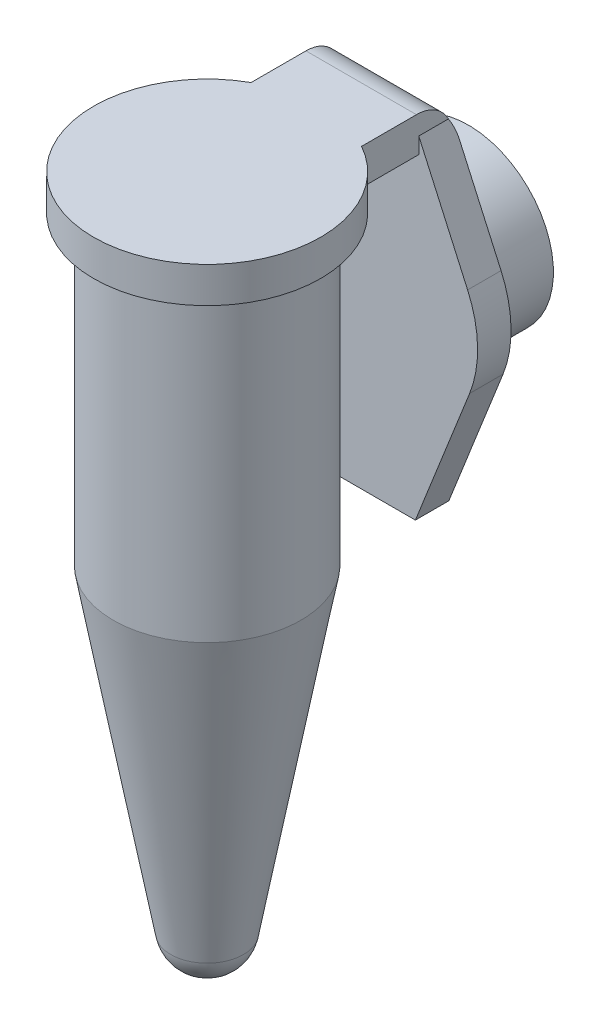
ISO-10303-21;
HEADER;
FILE_DESCRIPTION(('STEP AP214'),'2;1');
FILE_NAME('part.step','',(''),(''),'','','');
FILE_SCHEMA(('AUTOMOTIVE_DESIGN { 1 0 10303 214 1 1 1 1 }'));
ENDSEC;
DATA;
#1=APPLICATION_CONTEXT('core data for automotive mechanical design processes');
#2=APPLICATION_PROTOCOL_DEFINITION('international standard','automotive_design',2000,#1);
#3=PRODUCT_CONTEXT('',#1,'mechanical');
#4=PRODUCT('Part','Part','',(#3));
#5=PRODUCT_RELATED_PRODUCT_CATEGORY('part','',(#4));
#6=PRODUCT_DEFINITION_FORMATION('','',#4);
#7=PRODUCT_DEFINITION_CONTEXT('part definition',#1,'design');
#8=PRODUCT_DEFINITION('design','',#6,#7);
#9=PRODUCT_DEFINITION_SHAPE('','',#8);
#10=(LENGTH_UNIT() NAMED_UNIT(*) SI_UNIT(.MILLI.,.METRE.));
#11=(NAMED_UNIT(*) PLANE_ANGLE_UNIT() SI_UNIT($,.RADIAN.));
#12=(NAMED_UNIT(*) SI_UNIT($,.STERADIAN.) SOLID_ANGLE_UNIT());
#13=UNCERTAINTY_MEASURE_WITH_UNIT(LENGTH_MEASURE(1.E-05),#10,'distance_accuracy_value','');
#14=(GEOMETRIC_REPRESENTATION_CONTEXT(3) GLOBAL_UNCERTAINTY_ASSIGNED_CONTEXT((#13)) GLOBAL_UNIT_ASSIGNED_CONTEXT((#10,
#11,#12)) REPRESENTATION_CONTEXT('',''));
#15=CARTESIAN_POINT('',(0.,0.,0.));
#16=DIRECTION('',(0.,0.,1.));
#17=DIRECTION('',(1.,0.,0.));
#18=AXIS2_PLACEMENT_3D('',#15,#16,#17);
#19=CARTESIAN_POINT('',(0.,28.8,-10.6174678908489));
#20=DIRECTION('',(0.,0.,-1.));
#21=DIRECTION('',(-1.,0.,0.));
#22=AXIS2_PLACEMENT_3D('',#19,#20,#21);
#23=PLANE('',#22);
#24=DIRECTION('',(0.409269157803087,0.912413698094867,0.));
#25=VECTOR('',#24,1.);
#26=CARTESIAN_POINT('',(-5.82119939384525,31.4111372267837,-10.6174678908489));
#27=LINE('',#26,#25);
#28=CARTESIAN_POINT('',(-5.82119939384525,31.4111372267837,-10.6174678908489));
#29=VERTEX_POINT('',#28);
#30=CARTESIAN_POINT('',(-3.49370091197873,36.6,-10.6174678908489));
#31=VERTEX_POINT('',#30);
#32=EDGE_CURVE('E180',#29,#31,#27,.T.);
#33=ORIENTED_EDGE('',*,*,#32,.T.);
#34=DIRECTION('',(1.,0.,0.));
#35=VECTOR('',#34,1.);
#36=CARTESIAN_POINT('',(0.,36.6,-10.6174678908489));
#37=LINE('',#36,#35);
#38=CARTESIAN_POINT('',(3.49370091197873,36.6,-10.6174678908489));
#39=VERTEX_POINT('',#38);
#40=EDGE_CURVE('E150',#31,#39,#37,.T.);
#41=ORIENTED_EDGE('',*,*,#40,.T.);
#42=DIRECTION('',(0.409269157803087,-0.912413698094868,0.));
#43=VECTOR('',#42,1.);
#44=CARTESIAN_POINT('',(5.82119939384525,31.4111372267837,-10.6174678908489));
#45=LINE('',#44,#43);
#46=CARTESIAN_POINT('',(5.82119939384525,31.4111372267837,-10.6174678908489));
#47=VERTEX_POINT('',#46);
#48=EDGE_CURVE('E142',#39,#47,#45,.T.);
#49=ORIENTED_EDGE('',*,*,#48,.T.);
#50=CARTESIAN_POINT('',(0.,28.8,-10.6174678908489));
#51=DIRECTION('',(0.,0.,-1.));
#52=DIRECTION('',(-1.,0.,0.));
#53=AXIS2_PLACEMENT_3D('',#50,#51,#52);
#54=CIRCLE('',#53,6.38);
#55=CARTESIAN_POINT('',(5.93128800673835,26.4496335219541,-10.6174678908489));
#56=VERTEX_POINT('',#55);
#57=EDGE_CURVE('E147',#47,#56,#54,.T.);
#58=ORIENTED_EDGE('',*,*,#57,.T.);
#59=DIRECTION('',(-0.368395999693712,-0.929668966573409,0.));
#60=VECTOR('',#59,1.);
#61=CARTESIAN_POINT('',(2.9,18.8,-10.6174678908489));
#62=LINE('',#61,#60);
#63=CARTESIAN_POINT('',(2.9,18.8,-10.6174678908489));
#64=VERTEX_POINT('',#63);
#65=EDGE_CURVE('E169',#56,#64,#62,.T.);
#66=ORIENTED_EDGE('',*,*,#65,.T.);
#67=DIRECTION('',(-1.,0.,0.));
#68=VECTOR('',#67,1.);
#69=CARTESIAN_POINT('',(2.9,18.8,-10.6174678908489));
#70=LINE('',#69,#68);
#71=CARTESIAN_POINT('',(-2.9,18.8,-10.6174678908489));
#72=VERTEX_POINT('',#71);
#73=EDGE_CURVE('E171',#64,#72,#70,.T.);
#74=ORIENTED_EDGE('',*,*,#73,.T.);
#75=DIRECTION('',(-0.368395999693711,0.929668966573409,0.));
#76=VECTOR('',#75,1.);
#77=CARTESIAN_POINT('',(-2.9,18.8,-10.6174678908489));
#78=LINE('',#77,#76);
#79=CARTESIAN_POINT('',(-5.93128800673835,26.4496335219541,-10.6174678908489));
#80=VERTEX_POINT('',#79);
#81=EDGE_CURVE('E176',#72,#80,#78,.T.);
#82=ORIENTED_EDGE('',*,*,#81,.T.);
#83=CARTESIAN_POINT('',(0.,28.8,-10.6174678908489));
#84=DIRECTION('',(0.,0.,-1.));
#85=DIRECTION('',(-1.,0.,0.));
#86=AXIS2_PLACEMENT_3D('',#83,#84,#85);
#87=CIRCLE('',#86,6.38);
#88=EDGE_CURVE('E178',#80,#29,#87,.T.);
#89=ORIENTED_EDGE('',*,*,#88,.T.);
#90=EDGE_LOOP('',(#33,#41,#49,#58,#66,#74,#82,#89));
#91=FACE_BOUND('',#90,.T.);
#92=CARTESIAN_POINT('',(0.,28.8,-10.6174678908489));
#93=DIRECTION('',(0.,0.,-1.));
#94=DIRECTION('',(-1.,0.,0.));
#95=AXIS2_PLACEMENT_3D('',#92,#93,#94);
#96=CIRCLE('',#95,4.75);
#97=CARTESIAN_POINT('',(-4.75,28.8,-10.6174678908489));
#98=VERTEX_POINT('',#97);
#99=EDGE_CURVE('E309',#98,#98,#96,.T.);
#100=ORIENTED_EDGE('',*,*,#99,.F.);
#101=EDGE_LOOP('',(#100));
#102=FACE_BOUND('',#101,.T.);
#103=ADVANCED_FACE('F39',(#91,#102),#23,.T.);
#104=CARTESIAN_POINT('',(6.35,36.6,0.));
#105=DIRECTION('',(0.,-1.,0.));
#106=DIRECTION('',(0.,0.,-1.));
#107=AXIS2_PLACEMENT_3D('',#104,#105,#106);
#108=PLANE('',#107);
#109=CARTESIAN_POINT('',(0.,36.6,0.));
#110=DIRECTION('',(0.,-1.,0.));
#111=DIRECTION('',(0.,0.,-1.));
#112=AXIS2_PLACEMENT_3D('',#109,#110,#111);
#113=CIRCLE('',#112,6.35);
#114=CARTESIAN_POINT('',(3.09,36.6,-5.54746789084894));
#115=VERTEX_POINT('',#114);
#116=CARTESIAN_POINT('',(-3.09,36.6,-5.54746789084894));
#117=VERTEX_POINT('',#116);
#118=EDGE_CURVE('E238',#115,#117,#113,.T.);
#119=ORIENTED_EDGE('',*,*,#118,.T.);
#120=DIRECTION('',(0.,0.,1.));
#121=VECTOR('',#120,1.);
#122=CARTESIAN_POINT('',(-3.09,36.6,-5.54746789084894));
#123=LINE('',#122,#121);
#124=CARTESIAN_POINT('',(-3.09,36.6,-8.74746789084894));
#125=VERTEX_POINT('',#124);
#126=EDGE_CURVE('E210',#125,#117,#123,.T.);
#127=ORIENTED_EDGE('',*,*,#126,.F.);
#128=DIRECTION('',(-1.,0.,0.));
#129=VECTOR('',#128,1.);
#130=CARTESIAN_POINT('',(-3.09,36.6,-8.74746789084894));
#131=LINE('',#130,#129);
#132=CARTESIAN_POINT('',(3.09,36.6,-8.74746789084894));
#133=VERTEX_POINT('',#132);
#134=EDGE_CURVE('E218',#133,#125,#131,.T.);
#135=ORIENTED_EDGE('',*,*,#134,.F.);
#136=DIRECTION('',(0.,0.,-1.));
#137=VECTOR('',#136,1.);
#138=CARTESIAN_POINT('',(3.09,36.6,-5.54746789084894));
#139=LINE('',#138,#137);
#140=EDGE_CURVE('E214',#115,#133,#139,.T.);
#141=ORIENTED_EDGE('',*,*,#140,.F.);
#142=EDGE_LOOP('',(#119,#127,#135,#141));
#143=FACE_BOUND('',#142,.T.);
#144=CARTESIAN_POINT('',(0.,36.6,0.));
#145=DIRECTION('',(0.,-1.,0.));
#146=DIRECTION('',(0.,0.,-1.));
#147=AXIS2_PLACEMENT_3D('',#144,#145,#146);
#148=CIRCLE('',#147,5.25);
#149=CARTESIAN_POINT('',(0.,36.6,-5.25));
#150=VERTEX_POINT('',#149);
#151=EDGE_CURVE('E272',#150,#150,#148,.T.);
#152=ORIENTED_EDGE('',*,*,#151,.F.);
#153=EDGE_LOOP('',(#152));
#154=FACE_BOUND('',#153,.T.);
#155=ADVANCED_FACE('F336',(#143,#154),#108,.T.);
#156=CARTESIAN_POINT('',(0.,0.,0.));
#157=DIRECTION('',(0.,-1.,0.));
#158=DIRECTION('',(0.,0.,-1.));
#159=AXIS2_PLACEMENT_3D('',#156,#157,#158);
#160=CYLINDRICAL_SURFACE('',#159,5.25);
#161=ORIENTED_EDGE('',*,*,#151,.T.);
#162=EDGE_LOOP('',(#161));
#163=FACE_BOUND('',#162,.T.);
#164=CARTESIAN_POINT('',(0.,19.5,0.));
#165=DIRECTION('',(0.,-1.,0.));
#166=DIRECTION('',(0.,0.,-1.));
#167=AXIS2_PLACEMENT_3D('',#164,#165,#166);
#168=CIRCLE('',#167,5.25);
#169=CARTESIAN_POINT('',(0.,19.5,-5.25));
#170=VERTEX_POINT('',#169);
#171=EDGE_CURVE('E277',#170,#170,#168,.T.);
#172=ORIENTED_EDGE('',*,*,#171,.F.);
#173=EDGE_LOOP('',(#172));
#174=FACE_BOUND('',#173,.T.);
#175=ADVANCED_FACE('F343',(#163,#174),#160,.T.);
#176=CARTESIAN_POINT('',(0.,1.7,0.));
#177=DIRECTION('',(0.,1.,0.));
#178=DIRECTION('',(0.,0.,1.));
#179=AXIS2_PLACEMENT_3D('',#176,#177,#178);
#180=CONICAL_SURFACE('',#179,2.03460219547495,0.178713099540611);
#181=ORIENTED_EDGE('',*,*,#171,.T.);
#182=EDGE_LOOP('',(#181));
#183=FACE_BOUND('',#182,.T.);
#184=CARTESIAN_POINT('',(0.,1.7,0.));
#185=DIRECTION('',(0.,-1.,0.));
#186=DIRECTION('',(0.,0.,-1.));
#187=AXIS2_PLACEMENT_3D('',#184,#185,#186);
#188=CIRCLE('',#187,2.03460219547495);
#189=CARTESIAN_POINT('',(0.,1.7,-2.03460219547495));
#190=VERTEX_POINT('',#189);
#191=EDGE_CURVE('E281',#190,#190,#188,.T.);
#192=ORIENTED_EDGE('',*,*,#191,.F.);
#193=EDGE_LOOP('',(#192));
#194=FACE_BOUND('',#193,.T.);
#195=ADVANCED_FACE('F450',(#183,#194),#180,.T.);
#196=CARTESIAN_POINT('',(0.,2.06753120406809,0.));
#197=DIRECTION('',(0.,-1.,0.));
#198=DIRECTION('',(1.,0.,0.));
#199=AXIS2_PLACEMENT_3D('',#196,#197,#198);
#200=SPHERICAL_SURFACE('',#199,2.06753120406809);
#201=ORIENTED_EDGE('',*,*,#191,.T.);
#202=EDGE_LOOP('',(#201));
#203=FACE_BOUND('',#202,.T.);
#204=ADVANCED_FACE('F446',(#203),#200,.T.);
#205=CARTESIAN_POINT('',(0.,38.6,0.));
#206=DIRECTION('',(0.,1.,0.));
#207=DIRECTION('',(0.,0.,1.));
#208=AXIS2_PLACEMENT_3D('',#205,#206,#207);
#209=PLANE('',#208);
#210=DIRECTION('',(0.,0.,-1.));
#211=VECTOR('',#210,1.);
#212=CARTESIAN_POINT('',(3.09,38.6,-5.54746789084894));
#213=LINE('',#212,#211);
#214=CARTESIAN_POINT('',(3.09,38.6,-5.54746789084894));
#215=VERTEX_POINT('',#214);
#216=CARTESIAN_POINT('',(3.09,38.6,-8.61746789084894));
#217=VERTEX_POINT('',#216);
#218=EDGE_CURVE('E215',#215,#217,#213,.T.);
#219=ORIENTED_EDGE('',*,*,#218,.T.);
#220=DIRECTION('',(1.,0.,0.));
#221=VECTOR('',#220,1.);
#222=CARTESIAN_POINT('',(0.,38.6,-8.61746789084894));
#223=LINE('',#222,#221);
#224=CARTESIAN_POINT('',(-3.09,38.6,-8.61746789084894));
#225=VERTEX_POINT('',#224);
#226=EDGE_CURVE('E64',#217,#225,#223,.F.);
#227=ORIENTED_EDGE('',*,*,#226,.T.);
#228=DIRECTION('',(0.,0.,1.));
#229=VECTOR('',#228,1.);
#230=CARTESIAN_POINT('',(-3.09,38.6,-5.54746789084894));
#231=LINE('',#230,#229);
#232=CARTESIAN_POINT('',(-3.09,38.6,-5.54746789084894));
#233=VERTEX_POINT('',#232);
#234=EDGE_CURVE('E223',#225,#233,#231,.T.);
#235=ORIENTED_EDGE('',*,*,#234,.T.);
#236=CARTESIAN_POINT('',(0.,38.6,0.));
#237=DIRECTION('',(0.,-1.,0.));
#238=DIRECTION('',(0.,0.,-1.));
#239=AXIS2_PLACEMENT_3D('',#236,#237,#238);
#240=CIRCLE('',#239,6.35);
#241=EDGE_CURVE('E286',#215,#233,#240,.T.);
#242=ORIENTED_EDGE('',*,*,#241,.F.);
#243=EDGE_LOOP('',(#219,#227,#235,#242));
#244=FACE_BOUND('',#243,.T.);
#245=ADVANCED_FACE('F442',(#244),#209,.T.);
#246=CARTESIAN_POINT('',(0.,0.,0.));
#247=DIRECTION('',(0.,-1.,0.));
#248=DIRECTION('',(0.,0.,-1.));
#249=AXIS2_PLACEMENT_3D('',#246,#247,#248);
#250=CYLINDRICAL_SURFACE('',#249,6.35);
#251=DIRECTION('',(0.,1.,0.));
#252=VECTOR('',#251,1.);
#253=CARTESIAN_POINT('',(-3.09,36.6,-5.54746789084894));
#254=LINE('',#253,#252);
#255=EDGE_CURVE('E222',#117,#233,#254,.T.);
#256=ORIENTED_EDGE('',*,*,#255,.F.);
#257=ORIENTED_EDGE('',*,*,#118,.F.);
#258=DIRECTION('',(0.,1.,0.));
#259=VECTOR('',#258,1.);
#260=CARTESIAN_POINT('',(3.09,36.6,-5.54746789084894));
#261=LINE('',#260,#259);
#262=EDGE_CURVE('E292',#115,#215,#261,.T.);
#263=ORIENTED_EDGE('',*,*,#262,.T.);
#264=ORIENTED_EDGE('',*,*,#241,.T.);
#265=EDGE_LOOP('',(#256,#257,#263,#264));
#266=FACE_BOUND('',#265,.T.);
#267=ADVANCED_FACE('F438',(#266),#250,.T.);
#268=CARTESIAN_POINT('',(-3.09,36.6,-5.54746789084894));
#269=DIRECTION('',(-1.,0.,0.));
#270=DIRECTION('',(0.,0.,1.));
#271=AXIS2_PLACEMENT_3D('',#268,#269,#270);
#272=PLANE('',#271);
#273=ORIENTED_EDGE('',*,*,#234,.F.);
#274=CARTESIAN_POINT('',(-3.09,36.6,-8.61746789084894));
#275=DIRECTION('',(-1.,0.,0.));
#276=DIRECTION('',(0.,0.,1.));
#277=AXIS2_PLACEMENT_3D('',#274,#275,#276);
#278=CIRCLE('',#277,2.);
#279=CARTESIAN_POINT('',(-3.09,37.5,-10.4035250007981));
#280=VERTEX_POINT('',#279);
#281=EDGE_CURVE('E47',#225,#280,#278,.T.);
#282=ORIENTED_EDGE('',*,*,#281,.T.);
#283=DIRECTION('',(0.,0.,1.));
#284=VECTOR('',#283,1.);
#285=CARTESIAN_POINT('',(-3.09,37.5,-10.6174678908489));
#286=LINE('',#285,#284);
#287=CARTESIAN_POINT('',(-3.09,37.5,-8.74746789084894));
#288=VERTEX_POINT('',#287);
#289=EDGE_CURVE('E183',#280,#288,#286,.T.);
#290=ORIENTED_EDGE('',*,*,#289,.T.);
#291=DIRECTION('',(0.,1.,0.));
#292=VECTOR('',#291,1.);
#293=CARTESIAN_POINT('',(-3.09,36.6,-8.74746789084894));
#294=LINE('',#293,#292);
#295=EDGE_CURVE('E233',#125,#288,#294,.T.);
#296=ORIENTED_EDGE('',*,*,#295,.F.);
#297=ORIENTED_EDGE('',*,*,#126,.T.);
#298=ORIENTED_EDGE('',*,*,#255,.T.);
#299=EDGE_LOOP('',(#273,#282,#290,#296,#297,#298));
#300=FACE_BOUND('',#299,.T.);
#301=ADVANCED_FACE('F441',(#300),#272,.T.);
#302=CARTESIAN_POINT('',(3.09,36.6,-5.54746789084894));
#303=DIRECTION('',(1.,0.,0.));
#304=DIRECTION('',(0.,0.,-1.));
#305=AXIS2_PLACEMENT_3D('',#302,#303,#304);
#306=PLANE('',#305);
#307=DIRECTION('',(0.,0.,1.));
#308=VECTOR('',#307,1.);
#309=CARTESIAN_POINT('',(3.09,37.5,-10.6174678908489));
#310=LINE('',#309,#308);
#311=CARTESIAN_POINT('',(3.09,37.5,-10.4035250007981));
#312=VERTEX_POINT('',#311);
#313=CARTESIAN_POINT('',(3.09,37.5,-8.74746789084894));
#314=VERTEX_POINT('',#313);
#315=EDGE_CURVE('E163',#312,#314,#310,.T.);
#316=ORIENTED_EDGE('',*,*,#315,.F.);
#317=CARTESIAN_POINT('',(3.09,36.6,-8.61746789084894));
#318=DIRECTION('',(1.,0.,0.));
#319=DIRECTION('',(0.,0.,-1.));
#320=AXIS2_PLACEMENT_3D('',#317,#318,#319);
#321=CIRCLE('',#320,2.);
#322=EDGE_CURVE('E255',#312,#217,#321,.T.);
#323=ORIENTED_EDGE('',*,*,#322,.T.);
#324=ORIENTED_EDGE('',*,*,#218,.F.);
#325=ORIENTED_EDGE('',*,*,#262,.F.);
#326=ORIENTED_EDGE('',*,*,#140,.T.);
#327=DIRECTION('',(0.,1.,0.));
#328=VECTOR('',#327,1.);
#329=CARTESIAN_POINT('',(3.09,36.6,-8.74746789084894));
#330=LINE('',#329,#328);
#331=EDGE_CURVE('E239',#133,#314,#330,.T.);
#332=ORIENTED_EDGE('',*,*,#331,.T.);
#333=EDGE_LOOP('',(#316,#323,#324,#325,#326,#332));
#334=FACE_BOUND('',#333,.T.);
#335=ADVANCED_FACE('F300',(#334),#306,.T.);
#336=CARTESIAN_POINT('',(5.82119939384525,31.4111372267837,-10.6174678908489));
#337=DIRECTION('',(-0.912413698094868,-0.409269157803087,0.));
#338=DIRECTION('',(0.409269157803087,-0.912413698094868,0.));
#339=AXIS2_PLACEMENT_3D('',#336,#337,#338);
#340=PLANE('',#339);
#341=ORIENTED_EDGE('',*,*,#48,.F.);
#342=CARTESIAN_POINT('',(3.49370091197873,36.6,-8.61746789084894));
#343=DIRECTION('',(-0.912413698094868,-0.409269157803087,0.));
#344=DIRECTION('',(0.409269157803087,-0.912413698094868,0.));
#345=AXIS2_PLACEMENT_3D('',#342,#343,#344);
#346=ELLIPSE('',#345,2.19198813452278,2.);
#347=EDGE_CURVE('E257',#39,#312,#346,.F.);
#348=ORIENTED_EDGE('',*,*,#347,.T.);
#349=ORIENTED_EDGE('',*,*,#315,.T.);
#350=DIRECTION('',(0.409269157803087,-0.912413698094868,0.));
#351=VECTOR('',#350,1.);
#352=CARTESIAN_POINT('',(5.82119939384525,31.4111372267837,-8.74746789084894));
#353=LINE('',#352,#351);
#354=CARTESIAN_POINT('',(5.82119939384525,31.4111372267837,-8.74746789084894));
#355=VERTEX_POINT('',#354);
#356=EDGE_CURVE('E159',#314,#355,#353,.T.);
#357=ORIENTED_EDGE('',*,*,#356,.T.);
#358=DIRECTION('',(0.,0.,1.));
#359=VECTOR('',#358,1.);
#360=CARTESIAN_POINT('',(5.82119939384525,31.4111372267837,-10.6174678908489));
#361=LINE('',#360,#359);
#362=EDGE_CURVE('E156',#47,#355,#361,.T.);
#363=ORIENTED_EDGE('',*,*,#362,.F.);
#364=EDGE_LOOP('',(#341,#348,#349,#357,#363));
#365=FACE_BOUND('',#364,.T.);
#366=ADVANCED_FACE('F157',(#365),#340,.F.);
#367=CARTESIAN_POINT('',(0.,28.8,-10.6174678908489));
#368=DIRECTION('',(0.,0.,1.));
#369=DIRECTION('',(1.,0.,0.));
#370=AXIS2_PLACEMENT_3D('',#367,#368,#369);
#371=CYLINDRICAL_SURFACE('',#370,6.38);
#372=CARTESIAN_POINT('',(0.,28.8,-8.74746789084894));
#373=DIRECTION('',(0.,0.,-1.));
#374=DIRECTION('',(-1.,0.,0.));
#375=AXIS2_PLACEMENT_3D('',#372,#373,#374);
#376=CIRCLE('',#375,6.38);
#377=CARTESIAN_POINT('',(5.93128800673835,26.4496335219541,-8.74746789084894));
#378=VERTEX_POINT('',#377);
#379=EDGE_CURVE('E184',#355,#378,#376,.T.);
#380=ORIENTED_EDGE('',*,*,#379,.T.);
#381=DIRECTION('',(0.,0.,1.));
#382=VECTOR('',#381,1.);
#383=CARTESIAN_POINT('',(5.93128800673835,26.4496335219541,-10.6174678908489));
#384=LINE('',#383,#382);
#385=EDGE_CURVE('E164',#56,#378,#384,.T.);
#386=ORIENTED_EDGE('',*,*,#385,.F.);
#387=ORIENTED_EDGE('',*,*,#57,.F.);
#388=ORIENTED_EDGE('',*,*,#362,.T.);
#389=EDGE_LOOP('',(#380,#386,#387,#388));
#390=FACE_BOUND('',#389,.T.);
#391=ADVANCED_FACE('F166',(#390),#371,.T.);
#392=CARTESIAN_POINT('',(2.9,18.8,-10.6174678908489));
#393=DIRECTION('',(-0.929668966573409,0.368395999693712,0.));
#394=DIRECTION('',(-0.368395999693712,-0.929668966573409,0.));
#395=AXIS2_PLACEMENT_3D('',#392,#393,#394);
#396=PLANE('',#395);
#397=DIRECTION('',(-0.368395999693712,-0.929668966573409,0.));
#398=VECTOR('',#397,1.);
#399=CARTESIAN_POINT('',(2.9,18.8,-8.74746789084894));
#400=LINE('',#399,#398);
#401=CARTESIAN_POINT('',(2.9,18.8,-8.74746789084894));
#402=VERTEX_POINT('',#401);
#403=EDGE_CURVE('E187',#378,#402,#400,.T.);
#404=ORIENTED_EDGE('',*,*,#403,.T.);
#405=DIRECTION('',(0.,0.,1.));
#406=VECTOR('',#405,1.);
#407=CARTESIAN_POINT('',(2.9,18.8,-10.6174678908489));
#408=LINE('',#407,#406);
#409=EDGE_CURVE('E206',#64,#402,#408,.T.);
#410=ORIENTED_EDGE('',*,*,#409,.F.);
#411=ORIENTED_EDGE('',*,*,#65,.F.);
#412=ORIENTED_EDGE('',*,*,#385,.T.);
#413=EDGE_LOOP('',(#404,#410,#411,#412));
#414=FACE_BOUND('',#413,.T.);
#415=ADVANCED_FACE('F403',(#414),#396,.F.);
#416=CARTESIAN_POINT('',(2.9,18.8,-10.6174678908489));
#417=DIRECTION('',(0.,1.,0.));
#418=DIRECTION('',(0.,0.,1.));
#419=AXIS2_PLACEMENT_3D('',#416,#417,#418);
#420=PLANE('',#419);
#421=DIRECTION('',(-1.,0.,0.));
#422=VECTOR('',#421,1.);
#423=CARTESIAN_POINT('',(2.9,18.8,-8.74746789084894));
#424=LINE('',#423,#422);
#425=CARTESIAN_POINT('',(-2.9,18.8,-8.74746789084894));
#426=VERTEX_POINT('',#425);
#427=EDGE_CURVE('E189',#402,#426,#424,.T.);
#428=ORIENTED_EDGE('',*,*,#427,.T.);
#429=DIRECTION('',(0.,0.,1.));
#430=VECTOR('',#429,1.);
#431=CARTESIAN_POINT('',(-2.9,18.8,-10.6174678908489));
#432=LINE('',#431,#430);
#433=EDGE_CURVE('E203',#72,#426,#432,.T.);
#434=ORIENTED_EDGE('',*,*,#433,.F.);
#435=ORIENTED_EDGE('',*,*,#73,.F.);
#436=ORIENTED_EDGE('',*,*,#409,.T.);
#437=EDGE_LOOP('',(#428,#434,#435,#436));
#438=FACE_BOUND('',#437,.T.);
#439=ADVANCED_FACE('F393',(#438),#420,.F.);
#440=CARTESIAN_POINT('',(-2.9,18.8,-10.6174678908489));
#441=DIRECTION('',(0.929668966573409,0.368395999693711,0.));
#442=DIRECTION('',(-0.368395999693711,0.929668966573409,0.));
#443=AXIS2_PLACEMENT_3D('',#440,#441,#442);
#444=PLANE('',#443);
#445=DIRECTION('',(-0.368395999693711,0.929668966573409,0.));
#446=VECTOR('',#445,1.);
#447=CARTESIAN_POINT('',(-2.9,18.8,-8.74746789084894));
#448=LINE('',#447,#446);
#449=CARTESIAN_POINT('',(-5.93128800673835,26.4496335219541,-8.74746789084894));
#450=VERTEX_POINT('',#449);
#451=EDGE_CURVE('E191',#426,#450,#448,.T.);
#452=ORIENTED_EDGE('',*,*,#451,.T.);
#453=DIRECTION('',(0.,0.,1.));
#454=VECTOR('',#453,1.);
#455=CARTESIAN_POINT('',(-5.93128800673835,26.4496335219541,-10.6174678908489));
#456=LINE('',#455,#454);
#457=EDGE_CURVE('E200',#80,#450,#456,.T.);
#458=ORIENTED_EDGE('',*,*,#457,.F.);
#459=ORIENTED_EDGE('',*,*,#81,.F.);
#460=ORIENTED_EDGE('',*,*,#433,.T.);
#461=EDGE_LOOP('',(#452,#458,#459,#460));
#462=FACE_BOUND('',#461,.T.);
#463=ADVANCED_FACE('F381',(#462),#444,.F.);
#464=CARTESIAN_POINT('',(0.,28.8,-10.6174678908489));
#465=DIRECTION('',(0.,0.,1.));
#466=DIRECTION('',(1.,0.,0.));
#467=AXIS2_PLACEMENT_3D('',#464,#465,#466);
#468=CYLINDRICAL_SURFACE('',#467,6.38);
#469=CARTESIAN_POINT('',(0.,28.8,-8.74746789084894));
#470=DIRECTION('',(0.,0.,-1.));
#471=DIRECTION('',(-1.,0.,0.));
#472=AXIS2_PLACEMENT_3D('',#469,#470,#471);
#473=CIRCLE('',#472,6.38);
#474=CARTESIAN_POINT('',(-5.82119939384525,31.4111372267837,-8.74746789084894));
#475=VERTEX_POINT('',#474);
#476=EDGE_CURVE('E193',#450,#475,#473,.T.);
#477=ORIENTED_EDGE('',*,*,#476,.T.);
#478=DIRECTION('',(0.,0.,1.));
#479=VECTOR('',#478,1.);
#480=CARTESIAN_POINT('',(-5.82119939384525,31.4111372267837,-10.6174678908489));
#481=LINE('',#480,#479);
#482=EDGE_CURVE('E196',#29,#475,#481,.T.);
#483=ORIENTED_EDGE('',*,*,#482,.F.);
#484=ORIENTED_EDGE('',*,*,#88,.F.);
#485=ORIENTED_EDGE('',*,*,#457,.T.);
#486=EDGE_LOOP('',(#477,#483,#484,#485));
#487=FACE_BOUND('',#486,.T.);
#488=ADVANCED_FACE('F376',(#487),#468,.T.);
#489=CARTESIAN_POINT('',(-5.82119939384525,31.4111372267837,-10.6174678908489));
#490=DIRECTION('',(0.912413698094867,-0.409269157803087,0.));
#491=DIRECTION('',(0.409269157803087,0.912413698094868,0.));
#492=AXIS2_PLACEMENT_3D('',#489,#490,#491);
#493=PLANE('',#492);
#494=ORIENTED_EDGE('',*,*,#289,.F.);
#495=CARTESIAN_POINT('',(-3.49370091197873,36.6,-8.61746789084894));
#496=DIRECTION('',(0.912413698094867,-0.409269157803087,0.));
#497=DIRECTION('',(0.409269157803087,0.912413698094867,0.));
#498=AXIS2_PLACEMENT_3D('',#495,#496,#497);
#499=ELLIPSE('',#498,2.19198813452278,2.);
#500=EDGE_CURVE('E11',#280,#31,#499,.F.);
#501=ORIENTED_EDGE('',*,*,#500,.T.);
#502=ORIENTED_EDGE('',*,*,#32,.F.);
#503=ORIENTED_EDGE('',*,*,#482,.T.);
#504=DIRECTION('',(0.409269157803087,0.912413698094867,0.));
#505=VECTOR('',#504,1.);
#506=CARTESIAN_POINT('',(-5.82119939384525,31.4111372267837,-8.74746789084894));
#507=LINE('',#506,#505);
#508=EDGE_CURVE('E153',#475,#288,#507,.T.);
#509=ORIENTED_EDGE('',*,*,#508,.T.);
#510=EDGE_LOOP('',(#494,#501,#502,#503,#509));
#511=FACE_BOUND('',#510,.T.);
#512=ADVANCED_FACE('F332',(#511),#493,.F.);
#513=CARTESIAN_POINT('',(0.,28.8,-8.74746789084894));
#514=DIRECTION('',(0.,0.,-1.));
#515=DIRECTION('',(-1.,0.,0.));
#516=AXIS2_PLACEMENT_3D('',#513,#514,#515);
#517=PLANE('',#516);
#518=ORIENTED_EDGE('',*,*,#331,.F.);
#519=ORIENTED_EDGE('',*,*,#134,.T.);
#520=ORIENTED_EDGE('',*,*,#295,.T.);
#521=ORIENTED_EDGE('',*,*,#508,.F.);
#522=ORIENTED_EDGE('',*,*,#476,.F.);
#523=ORIENTED_EDGE('',*,*,#451,.F.);
#524=ORIENTED_EDGE('',*,*,#427,.F.);
#525=ORIENTED_EDGE('',*,*,#403,.F.);
#526=ORIENTED_EDGE('',*,*,#379,.F.);
#527=ORIENTED_EDGE('',*,*,#356,.F.);
#528=EDGE_LOOP('',(#518,#519,#520,#521,#522,#523,#524,#525,#526,#527));
#529=FACE_BOUND('',#528,.T.);
#530=ADVANCED_FACE('F304',(#529),#517,.F.);
#531=CARTESIAN_POINT('',(0.,28.8,-14.6174678908489));
#532=DIRECTION('',(0.,0.,-1.));
#533=DIRECTION('',(-1.,0.,0.));
#534=AXIS2_PLACEMENT_3D('',#531,#532,#533);
#535=PLANE('',#534);
#536=CARTESIAN_POINT('',(0.,28.8,-14.6174678908489));
#537=DIRECTION('',(0.,0.,-1.));
#538=DIRECTION('',(-1.,0.,0.));
#539=AXIS2_PLACEMENT_3D('',#536,#537,#538);
#540=CIRCLE('',#539,4.75);
#541=CARTESIAN_POINT('',(-4.75,28.8,-14.6174678908489));
#542=VERTEX_POINT('',#541);
#543=EDGE_CURVE('E306',#542,#542,#540,.T.);
#544=ORIENTED_EDGE('',*,*,#543,.T.);
#545=EDGE_LOOP('',(#544));
#546=FACE_BOUND('',#545,.T.);
#547=CARTESIAN_POINT('',(0.,28.8,-14.6174678908489));
#548=DIRECTION('',(0.,0.,-1.));
#549=DIRECTION('',(-1.,0.,0.));
#550=AXIS2_PLACEMENT_3D('',#547,#548,#549);
#551=CIRCLE('',#550,3.);
#552=CARTESIAN_POINT('',(-3.,28.8,-14.6174678908489));
#553=VERTEX_POINT('',#552);
#554=EDGE_CURVE('E315',#553,#553,#551,.T.);
#555=ORIENTED_EDGE('',*,*,#554,.F.);
#556=EDGE_LOOP('',(#555));
#557=FACE_BOUND('',#556,.T.);
#558=ADVANCED_FACE('F322',(#546,#557),#535,.T.);
#559=CARTESIAN_POINT('',(0.,28.8,-14.6174678908489));
#560=DIRECTION('',(0.,0.,1.));
#561=DIRECTION('',(1.,0.,0.));
#562=AXIS2_PLACEMENT_3D('',#559,#560,#561);
#563=CYLINDRICAL_SURFACE('',#562,4.75);
#564=ORIENTED_EDGE('',*,*,#543,.F.);
#565=EDGE_LOOP('',(#564));
#566=FACE_BOUND('',#565,.T.);
#567=ORIENTED_EDGE('',*,*,#99,.T.);
#568=EDGE_LOOP('',(#567));
#569=FACE_BOUND('',#568,.T.);
#570=ADVANCED_FACE('F324',(#566,#569),#563,.T.);
#571=CARTESIAN_POINT('',(0.,28.8,-14.6174678908489));
#572=DIRECTION('',(0.,0.,1.));
#573=DIRECTION('',(1.,0.,0.));
#574=AXIS2_PLACEMENT_3D('',#571,#572,#573);
#575=CYLINDRICAL_SURFACE('',#574,3.);
#576=ORIENTED_EDGE('',*,*,#554,.T.);
#577=EDGE_LOOP('',(#576));
#578=FACE_BOUND('',#577,.T.);
#579=CARTESIAN_POINT('',(0.,28.8,-10.6174678908489));
#580=DIRECTION('',(0.,0.,-1.));
#581=DIRECTION('',(-1.,0.,0.));
#582=AXIS2_PLACEMENT_3D('',#579,#580,#581);
#583=CIRCLE('',#582,3.);
#584=CARTESIAN_POINT('',(-3.,28.8,-10.6174678908489));
#585=VERTEX_POINT('',#584);
#586=EDGE_CURVE('E270',#585,#585,#583,.F.);
#587=ORIENTED_EDGE('',*,*,#586,.T.);
#588=EDGE_LOOP('',(#587));
#589=FACE_BOUND('',#588,.T.);
#590=ADVANCED_FACE('F320',(#578,#589),#575,.F.);
#591=ORIENTED_EDGE('',*,*,#586,.F.);
#592=EDGE_LOOP('',(#591));
#593=FACE_BOUND('',#592,.T.);
#594=ADVANCED_FACE('F338',(#593),#23,.T.);
#595=CARTESIAN_POINT('',(0.,36.6,-8.61746789084894));
#596=DIRECTION('',(1.,0.,0.));
#597=DIRECTION('',(0.,0.,-1.));
#598=AXIS2_PLACEMENT_3D('',#595,#596,#597);
#599=CYLINDRICAL_SURFACE('',#598,2.);
#600=ORIENTED_EDGE('',*,*,#281,.F.);
#601=ORIENTED_EDGE('',*,*,#226,.F.);
#602=ORIENTED_EDGE('',*,*,#322,.F.);
#603=ORIENTED_EDGE('',*,*,#347,.F.);
#604=ORIENTED_EDGE('',*,*,#40,.F.);
#605=ORIENTED_EDGE('',*,*,#500,.F.);
#606=EDGE_LOOP('',(#600,#601,#602,#603,#604,#605));
#607=FACE_BOUND('',#606,.T.);
#608=ADVANCED_FACE('F41',(#607),#599,.T.);
#609=CLOSED_SHELL('',(#103,#155,#175,#195,#204,#245,#267,#301,#335,#366,#391,#415,#439,#463,
#488,#512,#530,#558,#570,#590,#594,#608));
#610=MANIFOLD_SOLID_BREP('B2',#609);
#611=ADVANCED_BREP_SHAPE_REPRESENTATION('',(#18,#610),#14);
#612=SHAPE_DEFINITION_REPRESENTATION(#9,#611);
ENDSEC;
END-ISO-10303-21;
